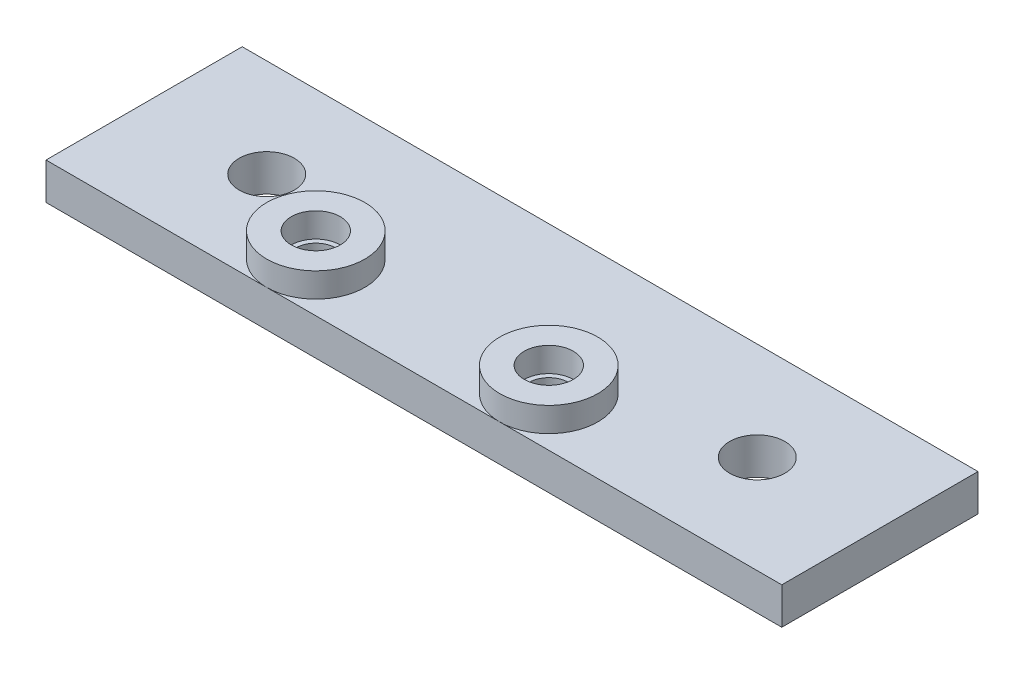
ISO-10303-21;
HEADER;
FILE_DESCRIPTION(('STEP AP214'),'2;1');
FILE_NAME('part.step','',(''),(''),'','','');
FILE_SCHEMA(('AUTOMOTIVE_DESIGN { 1 0 10303 214 1 1 1 1 }'));
ENDSEC;
DATA;
#1=APPLICATION_CONTEXT('core data for automotive mechanical design processes');
#2=APPLICATION_PROTOCOL_DEFINITION('international standard','automotive_design',2000,#1);
#3=PRODUCT_CONTEXT('',#1,'mechanical');
#4=PRODUCT('Part','Part','',(#3));
#5=PRODUCT_RELATED_PRODUCT_CATEGORY('part','',(#4));
#6=PRODUCT_DEFINITION_FORMATION('','',#4);
#7=PRODUCT_DEFINITION_CONTEXT('part definition',#1,'design');
#8=PRODUCT_DEFINITION('design','',#6,#7);
#9=PRODUCT_DEFINITION_SHAPE('','',#8);
#10=(LENGTH_UNIT() NAMED_UNIT(*) SI_UNIT(.MILLI.,.METRE.));
#11=(NAMED_UNIT(*) PLANE_ANGLE_UNIT() SI_UNIT($,.RADIAN.));
#12=(NAMED_UNIT(*) SI_UNIT($,.STERADIAN.) SOLID_ANGLE_UNIT());
#13=UNCERTAINTY_MEASURE_WITH_UNIT(LENGTH_MEASURE(1.E-05),#10,'distance_accuracy_value','');
#14=(GEOMETRIC_REPRESENTATION_CONTEXT(3) GLOBAL_UNCERTAINTY_ASSIGNED_CONTEXT((#13)) GLOBAL_UNIT_ASSIGNED_CONTEXT((#10,
#11,#12)) REPRESENTATION_CONTEXT('',''));
#15=CARTESIAN_POINT('',(0.,0.,0.));
#16=DIRECTION('',(0.,0.,1.));
#17=DIRECTION('',(1.,0.,0.));
#18=AXIS2_PLACEMENT_3D('',#15,#16,#17);
#19=CARTESIAN_POINT('',(0.,2.,0.));
#20=DIRECTION('',(0.,1.,0.));
#21=DIRECTION('',(0.,0.,1.));
#22=AXIS2_PLACEMENT_3D('',#19,#20,#21);
#23=PLANE('',#22);
#24=CARTESIAN_POINT('',(0.,2.,0.));
#25=DIRECTION('',(0.,1.,0.));
#26=DIRECTION('',(0.,0.,1.));
#27=AXIS2_PLACEMENT_3D('',#24,#25,#26);
#28=CIRCLE('',#27,4.);
#29=CARTESIAN_POINT('',(0.,2.,4.));
#30=VERTEX_POINT('',#29);
#31=EDGE_CURVE('E11',#30,#30,#28,.T.);
#32=ORIENTED_EDGE('',*,*,#31,.T.);
#33=EDGE_LOOP('',(#32));
#34=FACE_BOUND('',#33,.T.);
#35=CARTESIAN_POINT('',(0.,2.,0.));
#36=DIRECTION('',(0.,1.,0.));
#37=DIRECTION('',(0.,0.,1.));
#38=AXIS2_PLACEMENT_3D('',#35,#36,#37);
#39=CIRCLE('',#38,2.);
#40=CARTESIAN_POINT('',(0.,2.,2.));
#41=VERTEX_POINT('',#40);
#42=EDGE_CURVE('E129',#41,#41,#39,.T.);
#43=ORIENTED_EDGE('',*,*,#42,.F.);
#44=EDGE_LOOP('',(#43));
#45=FACE_BOUND('',#44,.T.);
#46=ADVANCED_FACE('F38',(#34,#45),#23,.T.);
#47=CARTESIAN_POINT('',(0.,2.,0.));
#48=DIRECTION('',(0.,-1.,0.));
#49=DIRECTION('',(0.,0.,-1.));
#50=AXIS2_PLACEMENT_3D('',#47,#48,#49);
#51=CYLINDRICAL_SURFACE('',#50,4.);
#52=ORIENTED_EDGE('',*,*,#31,.F.);
#53=EDGE_LOOP('',(#52));
#54=FACE_BOUND('',#53,.T.);
#55=CARTESIAN_POINT('',(0.,0.,0.));
#56=DIRECTION('',(0.,1.,0.));
#57=DIRECTION('',(0.,0.,1.));
#58=AXIS2_PLACEMENT_3D('',#55,#56,#57);
#59=CIRCLE('',#58,4.);
#60=CARTESIAN_POINT('',(0.,0.,4.));
#61=VERTEX_POINT('',#60);
#62=EDGE_CURVE('E48',#61,#61,#59,.T.);
#63=ORIENTED_EDGE('',*,*,#62,.T.);
#64=EDGE_LOOP('',(#63));
#65=FACE_BOUND('',#64,.T.);
#66=ADVANCED_FACE('F40',(#54,#65),#51,.T.);
#67=CARTESIAN_POINT('',(0.,2.,0.));
#68=DIRECTION('',(0.,-1.,0.));
#69=DIRECTION('',(0.,0.,-1.));
#70=AXIS2_PLACEMENT_3D('',#67,#68,#69);
#71=CYLINDRICAL_SURFACE('',#70,2.);
#72=ORIENTED_EDGE('',*,*,#42,.T.);
#73=EDGE_LOOP('',(#72));
#74=FACE_BOUND('',#73,.T.);
#75=CARTESIAN_POINT('',(0.,0.,0.));
#76=DIRECTION('',(0.,1.,0.));
#77=DIRECTION('',(0.,0.,1.));
#78=AXIS2_PLACEMENT_3D('',#75,#76,#77);
#79=CIRCLE('',#78,2.);
#80=CARTESIAN_POINT('',(0.,0.,2.));
#81=VERTEX_POINT('',#80);
#82=EDGE_CURVE('E128',#81,#81,#79,.T.);
#83=ORIENTED_EDGE('',*,*,#82,.F.);
#84=EDGE_LOOP('',(#83));
#85=FACE_BOUND('',#84,.T.);
#86=ADVANCED_FACE('F238',(#74,#85),#71,.F.);
#87=CARTESIAN_POINT('',(0.,0.,0.));
#88=DIRECTION('',(0.,-1.,0.));
#89=DIRECTION('',(0.,0.,-1.));
#90=AXIS2_PLACEMENT_3D('',#87,#88,#89);
#91=PLANE('',#90);
#92=CARTESIAN_POINT('',(0.,0.,0.));
#93=DIRECTION('',(0.,-1.,0.));
#94=DIRECTION('',(0.,0.,-1.));
#95=AXIS2_PLACEMENT_3D('',#92,#93,#94);
#96=CIRCLE('',#95,1.6);
#97=CARTESIAN_POINT('',(0.,0.,-1.6));
#98=VERTEX_POINT('',#97);
#99=EDGE_CURVE('E150',#98,#98,#96,.T.);
#100=ORIENTED_EDGE('',*,*,#99,.T.);
#101=EDGE_LOOP('',(#100));
#102=FACE_BOUND('',#101,.T.);
#103=ORIENTED_EDGE('',*,*,#82,.T.);
#104=EDGE_LOOP('',(#103));
#105=FACE_BOUND('',#104,.T.);
#106=ADVANCED_FACE('F212',(#102,#105),#91,.F.);
#107=CARTESIAN_POINT('',(0.,-3.,0.));
#108=DIRECTION('',(0.,-1.,0.));
#109=DIRECTION('',(0.,0.,-1.));
#110=AXIS2_PLACEMENT_3D('',#107,#108,#109);
#111=PLANE('',#110);
#112=CARTESIAN_POINT('',(0.,-3.,0.));
#113=DIRECTION('',(0.,-1.,0.));
#114=DIRECTION('',(0.,0.,-1.));
#115=AXIS2_PLACEMENT_3D('',#112,#113,#114);
#116=CIRCLE('',#115,1.6);
#117=CARTESIAN_POINT('',(0.,-3.,-1.6));
#118=VERTEX_POINT('',#117);
#119=EDGE_CURVE('E42',#118,#118,#116,.T.);
#120=ORIENTED_EDGE('',*,*,#119,.F.);
#121=EDGE_LOOP('',(#120));
#122=FACE_BOUND('',#121,.T.);
#123=CARTESIAN_POINT('',(19.,-3.,0.));
#124=DIRECTION('',(0.,-1.,0.));
#125=DIRECTION('',(0.,0.,-1.));
#126=AXIS2_PLACEMENT_3D('',#123,#124,#125);
#127=CIRCLE('',#126,1.6);
#128=CARTESIAN_POINT('',(19.,-3.,-1.6));
#129=VERTEX_POINT('',#128);
#130=EDGE_CURVE('E140',#129,#129,#127,.T.);
#131=ORIENTED_EDGE('',*,*,#130,.F.);
#132=EDGE_LOOP('',(#131));
#133=FACE_BOUND('',#132,.T.);
#134=CARTESIAN_POINT('',(-8.,-3.,-4.));
#135=DIRECTION('',(0.,-1.,0.));
#136=DIRECTION('',(0.,0.,-1.));
#137=AXIS2_PLACEMENT_3D('',#134,#135,#136);
#138=CIRCLE('',#137,2.25);
#139=CARTESIAN_POINT('',(-8.,-3.,-6.25));
#140=VERTEX_POINT('',#139);
#141=EDGE_CURVE('E178',#140,#140,#138,.T.);
#142=ORIENTED_EDGE('',*,*,#141,.F.);
#143=EDGE_LOOP('',(#142));
#144=FACE_BOUND('',#143,.T.);
#145=DIRECTION('',(0.,0.,-1.));
#146=VECTOR('',#145,1.);
#147=CARTESIAN_POINT('',(-18.,-3.,4.));
#148=LINE('',#147,#146);
#149=CARTESIAN_POINT('',(-18.,-3.,4.));
#150=VERTEX_POINT('',#149);
#151=CARTESIAN_POINT('',(-18.,-3.,-12.));
#152=VERTEX_POINT('',#151);
#153=EDGE_CURVE('E102',#150,#152,#148,.T.);
#154=ORIENTED_EDGE('',*,*,#153,.T.);
#155=DIRECTION('',(1.,0.,0.));
#156=VECTOR('',#155,1.);
#157=CARTESIAN_POINT('',(-18.,-3.,-12.));
#158=LINE('',#157,#156);
#159=CARTESIAN_POINT('',(42.,-3.,-12.));
#160=VERTEX_POINT('',#159);
#161=EDGE_CURVE('E90',#152,#160,#158,.T.);
#162=ORIENTED_EDGE('',*,*,#161,.T.);
#163=DIRECTION('',(0.,0.,1.));
#164=VECTOR('',#163,1.);
#165=CARTESIAN_POINT('',(42.,-3.,4.));
#166=LINE('',#165,#164);
#167=CARTESIAN_POINT('',(42.,-3.,4.));
#168=VERTEX_POINT('',#167);
#169=EDGE_CURVE('E190',#160,#168,#166,.T.);
#170=ORIENTED_EDGE('',*,*,#169,.T.);
#171=DIRECTION('',(-1.,0.,0.));
#172=VECTOR('',#171,1.);
#173=CARTESIAN_POINT('',(-18.,-3.,4.));
#174=LINE('',#173,#172);
#175=EDGE_CURVE('E65',#168,#150,#174,.T.);
#176=ORIENTED_EDGE('',*,*,#175,.T.);
#177=EDGE_LOOP('',(#154,#162,#170,#176));
#178=FACE_BOUND('',#177,.T.);
#179=CARTESIAN_POINT('',(32.,-3.,-4.));
#180=DIRECTION('',(0.,-1.,0.));
#181=DIRECTION('',(0.,0.,-1.));
#182=AXIS2_PLACEMENT_3D('',#179,#180,#181);
#183=CIRCLE('',#182,2.25);
#184=CARTESIAN_POINT('',(32.,-3.,-6.25));
#185=VERTEX_POINT('',#184);
#186=EDGE_CURVE('E170',#185,#185,#183,.T.);
#187=ORIENTED_EDGE('',*,*,#186,.F.);
#188=EDGE_LOOP('',(#187));
#189=FACE_BOUND('',#188,.T.);
#190=ADVANCED_FACE('F209',(#122,#133,#144,#178,#189),#111,.T.);
#191=DIRECTION('',(-1.,0.,0.));
#192=VECTOR('',#191,1.);
#193=CARTESIAN_POINT('',(-18.,0.,4.));
#194=LINE('',#193,#192);
#195=CARTESIAN_POINT('',(19.,0.,4.));
#196=VERTEX_POINT('',#195);
#197=EDGE_CURVE('E56',#196,#61,#194,.T.);
#198=ORIENTED_EDGE('',*,*,#197,.F.);
#199=CARTESIAN_POINT('',(19.,0.,0.));
#200=DIRECTION('',(0.,1.,0.));
#201=DIRECTION('',(0.,0.,1.));
#202=AXIS2_PLACEMENT_3D('',#199,#200,#201);
#203=CIRCLE('',#202,4.);
#204=EDGE_CURVE('E108',#196,#196,#203,.T.);
#205=ORIENTED_EDGE('',*,*,#204,.F.);
#206=CARTESIAN_POINT('',(42.,0.,4.));
#207=VERTEX_POINT('',#206);
#208=EDGE_CURVE('E94',#207,#196,#194,.T.);
#209=ORIENTED_EDGE('',*,*,#208,.F.);
#210=DIRECTION('',(0.,0.,1.));
#211=VECTOR('',#210,1.);
#212=CARTESIAN_POINT('',(42.,0.,4.));
#213=LINE('',#212,#211);
#214=CARTESIAN_POINT('',(42.,0.,-12.));
#215=VERTEX_POINT('',#214);
#216=EDGE_CURVE('E112',#215,#207,#213,.T.);
#217=ORIENTED_EDGE('',*,*,#216,.F.);
#218=DIRECTION('',(1.,0.,0.));
#219=VECTOR('',#218,1.);
#220=CARTESIAN_POINT('',(-18.,0.,-12.));
#221=LINE('',#220,#219);
#222=CARTESIAN_POINT('',(-18.,0.,-12.));
#223=VERTEX_POINT('',#222);
#224=EDGE_CURVE('E197',#223,#215,#221,.T.);
#225=ORIENTED_EDGE('',*,*,#224,.F.);
#226=DIRECTION('',(0.,0.,-1.));
#227=VECTOR('',#226,1.);
#228=CARTESIAN_POINT('',(-18.,0.,4.));
#229=LINE('',#228,#227);
#230=CARTESIAN_POINT('',(-18.,0.,4.));
#231=VERTEX_POINT('',#230);
#232=EDGE_CURVE('E182',#231,#223,#229,.T.);
#233=ORIENTED_EDGE('',*,*,#232,.F.);
#234=EDGE_CURVE('E82',#61,#231,#194,.T.);
#235=ORIENTED_EDGE('',*,*,#234,.F.);
#236=ORIENTED_EDGE('',*,*,#62,.F.);
#237=EDGE_LOOP('',(#198,#205,#209,#217,#225,#233,#235,#236));
#238=FACE_BOUND('',#237,.T.);
#239=CARTESIAN_POINT('',(-8.,0.,-4.));
#240=DIRECTION('',(0.,-1.,0.));
#241=DIRECTION('',(0.,0.,-1.));
#242=AXIS2_PLACEMENT_3D('',#239,#240,#241);
#243=CIRCLE('',#242,2.25);
#244=CARTESIAN_POINT('',(-8.,0.,-6.25));
#245=VERTEX_POINT('',#244);
#246=EDGE_CURVE('E174',#245,#245,#243,.T.);
#247=ORIENTED_EDGE('',*,*,#246,.T.);
#248=EDGE_LOOP('',(#247));
#249=FACE_BOUND('',#248,.T.);
#250=CARTESIAN_POINT('',(32.,0.,-4.));
#251=DIRECTION('',(0.,-1.,0.));
#252=DIRECTION('',(0.,0.,-1.));
#253=AXIS2_PLACEMENT_3D('',#250,#251,#252);
#254=CIRCLE('',#253,2.25);
#255=CARTESIAN_POINT('',(32.,0.,-6.25));
#256=VERTEX_POINT('',#255);
#257=EDGE_CURVE('E167',#256,#256,#254,.T.);
#258=ORIENTED_EDGE('',*,*,#257,.T.);
#259=EDGE_LOOP('',(#258));
#260=FACE_BOUND('',#259,.T.);
#261=ADVANCED_FACE('F105',(#238,#249,#260),#91,.F.);
#262=CARTESIAN_POINT('',(-18.,-3.,4.));
#263=DIRECTION('',(1.,0.,0.));
#264=DIRECTION('',(0.,0.,-1.));
#265=AXIS2_PLACEMENT_3D('',#262,#263,#264);
#266=PLANE('',#265);
#267=ORIENTED_EDGE('',*,*,#232,.T.);
#268=DIRECTION('',(0.,1.,0.));
#269=VECTOR('',#268,1.);
#270=CARTESIAN_POINT('',(-18.,-3.,-12.));
#271=LINE('',#270,#269);
#272=EDGE_CURVE('E125',#152,#223,#271,.T.);
#273=ORIENTED_EDGE('',*,*,#272,.F.);
#274=ORIENTED_EDGE('',*,*,#153,.F.);
#275=DIRECTION('',(0.,1.,0.));
#276=VECTOR('',#275,1.);
#277=CARTESIAN_POINT('',(-18.,-3.,4.));
#278=LINE('',#277,#276);
#279=EDGE_CURVE('E116',#150,#231,#278,.T.);
#280=ORIENTED_EDGE('',*,*,#279,.T.);
#281=EDGE_LOOP('',(#267,#273,#274,#280));
#282=FACE_BOUND('',#281,.T.);
#283=ADVANCED_FACE('F208',(#282),#266,.F.);
#284=CARTESIAN_POINT('',(-18.,-3.,-12.));
#285=DIRECTION('',(0.,0.,1.));
#286=DIRECTION('',(1.,0.,0.));
#287=AXIS2_PLACEMENT_3D('',#284,#285,#286);
#288=PLANE('',#287);
#289=ORIENTED_EDGE('',*,*,#224,.T.);
#290=DIRECTION('',(0.,1.,0.));
#291=VECTOR('',#290,1.);
#292=CARTESIAN_POINT('',(42.,-3.,-12.));
#293=LINE('',#292,#291);
#294=EDGE_CURVE('E121',#160,#215,#293,.T.);
#295=ORIENTED_EDGE('',*,*,#294,.F.);
#296=ORIENTED_EDGE('',*,*,#161,.F.);
#297=ORIENTED_EDGE('',*,*,#272,.T.);
#298=EDGE_LOOP('',(#289,#295,#296,#297));
#299=FACE_BOUND('',#298,.T.);
#300=ADVANCED_FACE('F205',(#299),#288,.F.);
#301=CARTESIAN_POINT('',(42.,-3.,4.));
#302=DIRECTION('',(-1.,0.,0.));
#303=DIRECTION('',(0.,0.,1.));
#304=AXIS2_PLACEMENT_3D('',#301,#302,#303);
#305=PLANE('',#304);
#306=ORIENTED_EDGE('',*,*,#216,.T.);
#307=DIRECTION('',(0.,1.,0.));
#308=VECTOR('',#307,1.);
#309=CARTESIAN_POINT('',(42.,-3.,4.));
#310=LINE('',#309,#308);
#311=EDGE_CURVE('E97',#168,#207,#310,.T.);
#312=ORIENTED_EDGE('',*,*,#311,.F.);
#313=ORIENTED_EDGE('',*,*,#169,.F.);
#314=ORIENTED_EDGE('',*,*,#294,.T.);
#315=EDGE_LOOP('',(#306,#312,#313,#314));
#316=FACE_BOUND('',#315,.T.);
#317=ADVANCED_FACE('F201',(#316),#305,.F.);
#318=CARTESIAN_POINT('',(-18.,-3.,4.));
#319=DIRECTION('',(0.,0.,-1.));
#320=DIRECTION('',(-1.,0.,0.));
#321=AXIS2_PLACEMENT_3D('',#318,#319,#320);
#322=PLANE('',#321);
#323=ORIENTED_EDGE('',*,*,#208,.T.);
#324=ORIENTED_EDGE('',*,*,#197,.T.);
#325=ORIENTED_EDGE('',*,*,#234,.T.);
#326=ORIENTED_EDGE('',*,*,#279,.F.);
#327=ORIENTED_EDGE('',*,*,#175,.F.);
#328=ORIENTED_EDGE('',*,*,#311,.T.);
#329=EDGE_LOOP('',(#323,#324,#325,#326,#327,#328));
#330=FACE_BOUND('',#329,.T.);
#331=ADVANCED_FACE('F95',(#330),#322,.F.);
#332=CARTESIAN_POINT('',(-8.,-3.,-4.));
#333=DIRECTION('',(0.,1.,0.));
#334=DIRECTION('',(0.,0.,1.));
#335=AXIS2_PLACEMENT_3D('',#332,#333,#334);
#336=CYLINDRICAL_SURFACE('',#335,2.25);
#337=ORIENTED_EDGE('',*,*,#141,.T.);
#338=EDGE_LOOP('',(#337));
#339=FACE_BOUND('',#338,.T.);
#340=ORIENTED_EDGE('',*,*,#246,.F.);
#341=EDGE_LOOP('',(#340));
#342=FACE_BOUND('',#341,.T.);
#343=ADVANCED_FACE('F221',(#339,#342),#336,.F.);
#344=CARTESIAN_POINT('',(32.,-3.,-4.));
#345=DIRECTION('',(0.,1.,0.));
#346=DIRECTION('',(0.,0.,1.));
#347=AXIS2_PLACEMENT_3D('',#344,#345,#346);
#348=CYLINDRICAL_SURFACE('',#347,2.25);
#349=ORIENTED_EDGE('',*,*,#186,.T.);
#350=EDGE_LOOP('',(#349));
#351=FACE_BOUND('',#350,.T.);
#352=ORIENTED_EDGE('',*,*,#257,.F.);
#353=EDGE_LOOP('',(#352));
#354=FACE_BOUND('',#353,.T.);
#355=ADVANCED_FACE('F217',(#351,#354),#348,.F.);
#356=CARTESIAN_POINT('',(19.,2.,0.));
#357=DIRECTION('',(0.,1.,0.));
#358=DIRECTION('',(0.,0.,1.));
#359=AXIS2_PLACEMENT_3D('',#356,#357,#358);
#360=PLANE('',#359);
#361=CARTESIAN_POINT('',(19.,2.,0.));
#362=DIRECTION('',(0.,1.,0.));
#363=DIRECTION('',(0.,0.,1.));
#364=AXIS2_PLACEMENT_3D('',#361,#362,#363);
#365=CIRCLE('',#364,4.);
#366=CARTESIAN_POINT('',(19.,2.,4.));
#367=VERTEX_POINT('',#366);
#368=EDGE_CURVE('E163',#367,#367,#365,.T.);
#369=ORIENTED_EDGE('',*,*,#368,.T.);
#370=EDGE_LOOP('',(#369));
#371=FACE_BOUND('',#370,.T.);
#372=CARTESIAN_POINT('',(19.,2.,0.));
#373=DIRECTION('',(0.,1.,0.));
#374=DIRECTION('',(0.,0.,1.));
#375=AXIS2_PLACEMENT_3D('',#372,#373,#374);
#376=CIRCLE('',#375,2.);
#377=CARTESIAN_POINT('',(19.,2.,2.));
#378=VERTEX_POINT('',#377);
#379=EDGE_CURVE('E156',#378,#378,#376,.T.);
#380=ORIENTED_EDGE('',*,*,#379,.F.);
#381=EDGE_LOOP('',(#380));
#382=FACE_BOUND('',#381,.T.);
#383=ADVANCED_FACE('F220',(#371,#382),#360,.T.);
#384=CARTESIAN_POINT('',(19.,2.,0.));
#385=DIRECTION('',(0.,-1.,0.));
#386=DIRECTION('',(0.,0.,-1.));
#387=AXIS2_PLACEMENT_3D('',#384,#385,#386);
#388=CYLINDRICAL_SURFACE('',#387,4.);
#389=ORIENTED_EDGE('',*,*,#368,.F.);
#390=EDGE_LOOP('',(#389));
#391=FACE_BOUND('',#390,.T.);
#392=ORIENTED_EDGE('',*,*,#204,.T.);
#393=EDGE_LOOP('',(#392));
#394=FACE_BOUND('',#393,.T.);
#395=ADVANCED_FACE('F264',(#391,#394),#388,.T.);
#396=CARTESIAN_POINT('',(19.,2.,0.));
#397=DIRECTION('',(0.,-1.,0.));
#398=DIRECTION('',(0.,0.,-1.));
#399=AXIS2_PLACEMENT_3D('',#396,#397,#398);
#400=CYLINDRICAL_SURFACE('',#399,2.);
#401=ORIENTED_EDGE('',*,*,#379,.T.);
#402=EDGE_LOOP('',(#401));
#403=FACE_BOUND('',#402,.T.);
#404=CARTESIAN_POINT('',(19.,0.,0.));
#405=DIRECTION('',(0.,1.,0.));
#406=DIRECTION('',(0.,0.,1.));
#407=AXIS2_PLACEMENT_3D('',#404,#405,#406);
#408=CIRCLE('',#407,2.);
#409=CARTESIAN_POINT('',(19.,0.,2.));
#410=VERTEX_POINT('',#409);
#411=EDGE_CURVE('E155',#410,#410,#408,.T.);
#412=ORIENTED_EDGE('',*,*,#411,.F.);
#413=EDGE_LOOP('',(#412));
#414=FACE_BOUND('',#413,.T.);
#415=ADVANCED_FACE('F236',(#403,#414),#400,.F.);
#416=CARTESIAN_POINT('',(19.,0.,0.));
#417=DIRECTION('',(0.,-1.,0.));
#418=DIRECTION('',(0.,0.,-1.));
#419=AXIS2_PLACEMENT_3D('',#416,#417,#418);
#420=CIRCLE('',#419,1.6);
#421=CARTESIAN_POINT('',(19.,0.,-1.6));
#422=VERTEX_POINT('',#421);
#423=EDGE_CURVE('E137',#422,#422,#420,.T.);
#424=ORIENTED_EDGE('',*,*,#423,.T.);
#425=EDGE_LOOP('',(#424));
#426=FACE_BOUND('',#425,.T.);
#427=ORIENTED_EDGE('',*,*,#411,.T.);
#428=EDGE_LOOP('',(#427));
#429=FACE_BOUND('',#428,.T.);
#430=ADVANCED_FACE('F227',(#426,#429),#91,.F.);
#431=CARTESIAN_POINT('',(19.,-8.,0.));
#432=DIRECTION('',(0.,1.,0.));
#433=DIRECTION('',(0.,0.,1.));
#434=AXIS2_PLACEMENT_3D('',#431,#432,#433);
#435=CYLINDRICAL_SURFACE('',#434,1.6);
#436=ORIENTED_EDGE('',*,*,#130,.T.);
#437=EDGE_LOOP('',(#436));
#438=FACE_BOUND('',#437,.T.);
#439=ORIENTED_EDGE('',*,*,#423,.F.);
#440=EDGE_LOOP('',(#439));
#441=FACE_BOUND('',#440,.T.);
#442=ADVANCED_FACE('F235',(#438,#441),#435,.F.);
#443=CARTESIAN_POINT('',(0.,-8.,0.));
#444=DIRECTION('',(0.,1.,0.));
#445=DIRECTION('',(0.,0.,1.));
#446=AXIS2_PLACEMENT_3D('',#443,#444,#445);
#447=CYLINDRICAL_SURFACE('',#446,1.6);
#448=ORIENTED_EDGE('',*,*,#119,.T.);
#449=EDGE_LOOP('',(#448));
#450=FACE_BOUND('',#449,.T.);
#451=ORIENTED_EDGE('',*,*,#99,.F.);
#452=EDGE_LOOP('',(#451));
#453=FACE_BOUND('',#452,.T.);
#454=ADVANCED_FACE('F276',(#450,#453),#447,.F.);
#455=CLOSED_SHELL('',(#46,#66,#86,#106,#190,#261,#283,#300,#317,#331,#343,#355,#383,#395,#415,
#430,#442,#454));
#456=MANIFOLD_SOLID_BREP('B2',#455);
#457=ADVANCED_BREP_SHAPE_REPRESENTATION('',(#18,#456),#14);
#458=SHAPE_DEFINITION_REPRESENTATION(#9,#457);
ENDSEC;
END-ISO-10303-21;
